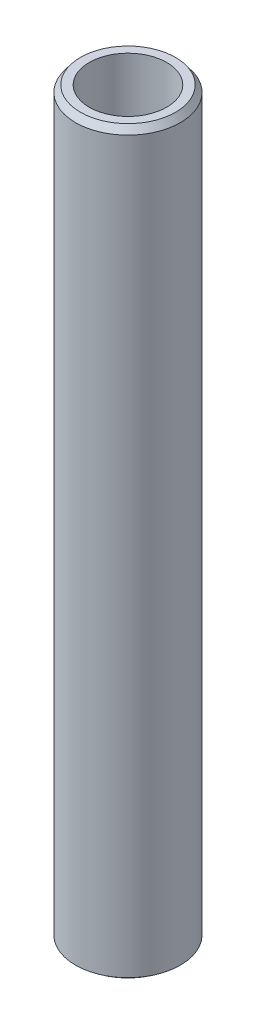
ISO-10303-21;
HEADER;
FILE_DESCRIPTION(('STEP AP214'),'2;1');
FILE_NAME('part.step','',(''),(''),'','','');
FILE_SCHEMA(('AUTOMOTIVE_DESIGN { 1 0 10303 214 1 1 1 1 }'));
ENDSEC;
DATA;
#1=APPLICATION_CONTEXT('core data for automotive mechanical design processes');
#2=APPLICATION_PROTOCOL_DEFINITION('international standard','automotive_design',2000,#1);
#3=PRODUCT_CONTEXT('',#1,'mechanical');
#4=PRODUCT('Part','Part','',(#3));
#5=PRODUCT_RELATED_PRODUCT_CATEGORY('part','',(#4));
#6=PRODUCT_DEFINITION_FORMATION('','',#4);
#7=PRODUCT_DEFINITION_CONTEXT('part definition',#1,'design');
#8=PRODUCT_DEFINITION('design','',#6,#7);
#9=PRODUCT_DEFINITION_SHAPE('','',#8);
#10=(LENGTH_UNIT() NAMED_UNIT(*) SI_UNIT(.MILLI.,.METRE.));
#11=(NAMED_UNIT(*) PLANE_ANGLE_UNIT() SI_UNIT($,.RADIAN.));
#12=(NAMED_UNIT(*) SI_UNIT($,.STERADIAN.) SOLID_ANGLE_UNIT());
#13=UNCERTAINTY_MEASURE_WITH_UNIT(LENGTH_MEASURE(1.E-05),#10,'distance_accuracy_value','');
#14=(GEOMETRIC_REPRESENTATION_CONTEXT(3) GLOBAL_UNCERTAINTY_ASSIGNED_CONTEXT((#13)) GLOBAL_UNIT_ASSIGNED_CONTEXT((#10,
#11,#12)) REPRESENTATION_CONTEXT('',''));
#15=CARTESIAN_POINT('',(0.,0.,0.));
#16=DIRECTION('',(0.,0.,1.));
#17=DIRECTION('',(1.,0.,0.));
#18=AXIS2_PLACEMENT_3D('',#15,#16,#17);
#19=CARTESIAN_POINT('',(0.,212.051565752174,0.));
#20=DIRECTION('',(0.,-1.,0.));
#21=DIRECTION('',(0.,0.,-1.));
#22=AXIS2_PLACEMENT_3D('',#19,#20,#21);
#23=CYLINDRICAL_SURFACE('',#22,15.);
#24=CARTESIAN_POINT('',(0.,210.178905890822,0.));
#25=DIRECTION('',(0.,1.,0.));
#26=DIRECTION('',(0.,0.,1.));
#27=AXIS2_PLACEMENT_3D('',#24,#25,#26);
#28=CIRCLE('',#27,15.);
#29=CARTESIAN_POINT('',(0.,210.178905890822,15.));
#30=VERTEX_POINT('',#29);
#31=EDGE_CURVE('E50',#30,#30,#28,.F.);
#32=ORIENTED_EDGE('',*,*,#31,.T.);
#33=EDGE_LOOP('',(#32));
#34=FACE_BOUND('',#33,.T.);
#35=CARTESIAN_POINT('',(0.,1.39279228129038,0.));
#36=DIRECTION('',(0.,1.,0.));
#37=DIRECTION('',(0.,0.,1.));
#38=AXIS2_PLACEMENT_3D('',#35,#36,#37);
#39=CIRCLE('',#38,15.);
#40=CARTESIAN_POINT('',(0.,1.39279228129038,15.));
#41=VERTEX_POINT('',#40);
#42=EDGE_CURVE('E51',#41,#41,#39,.T.);
#43=ORIENTED_EDGE('',*,*,#42,.T.);
#44=EDGE_LOOP('',(#43));
#45=FACE_BOUND('',#44,.T.);
#46=ADVANCED_FACE('F39',(#34,#45),#23,.T.);
#47=CARTESIAN_POINT('',(0.,212.051565752174,0.));
#48=DIRECTION('',(0.,1.,0.));
#49=DIRECTION('',(0.,0.,1.));
#50=AXIS2_PLACEMENT_3D('',#47,#48,#49);
#51=PLANE('',#50);
#52=CARTESIAN_POINT('',(0.,212.051565752174,0.));
#53=DIRECTION('',(0.,1.,0.));
#54=DIRECTION('',(0.,0.,1.));
#55=AXIS2_PLACEMENT_3D('',#52,#53,#54);
#56=CIRCLE('',#55,13.6072077187096);
#57=CARTESIAN_POINT('',(0.,212.051565752174,13.6072077187096));
#58=VERTEX_POINT('',#57);
#59=EDGE_CURVE('E54',#58,#58,#56,.T.);
#60=ORIENTED_EDGE('',*,*,#59,.T.);
#61=EDGE_LOOP('',(#60));
#62=FACE_BOUND('',#61,.T.);
#63=CARTESIAN_POINT('',(0.,212.051565752174,0.));
#64=DIRECTION('',(0.,1.,0.));
#65=DIRECTION('',(0.,0.,1.));
#66=AXIS2_PLACEMENT_3D('',#63,#64,#65);
#67=CIRCLE('',#66,11.097342256974);
#68=CARTESIAN_POINT('',(0.,212.051565752174,11.097342256974));
#69=VERTEX_POINT('',#68);
#70=EDGE_CURVE('E58',#69,#69,#67,.T.);
#71=ORIENTED_EDGE('',*,*,#70,.F.);
#72=EDGE_LOOP('',(#71));
#73=FACE_BOUND('',#72,.T.);
#74=ADVANCED_FACE('F69',(#62,#73),#51,.T.);
#75=CARTESIAN_POINT('',(0.,0.,0.));
#76=DIRECTION('',(0.,1.,0.));
#77=DIRECTION('',(0.,0.,1.));
#78=AXIS2_PLACEMENT_3D('',#75,#76,#77);
#79=PLANE('',#78);
#80=CARTESIAN_POINT('',(0.,0.,0.));
#81=DIRECTION('',(0.,1.,0.));
#82=DIRECTION('',(0.,0.,1.));
#83=AXIS2_PLACEMENT_3D('',#80,#81,#82);
#84=CIRCLE('',#83,13.1273401386477);
#85=CARTESIAN_POINT('',(0.,0.,13.1273401386477));
#86=VERTEX_POINT('',#85);
#87=EDGE_CURVE('E10',#86,#86,#84,.F.);
#88=ORIENTED_EDGE('',*,*,#87,.T.);
#89=EDGE_LOOP('',(#88));
#90=FACE_BOUND('',#89,.T.);
#91=CARTESIAN_POINT('',(0.,0.,0.));
#92=DIRECTION('',(0.,1.,0.));
#93=DIRECTION('',(0.,0.,1.));
#94=AXIS2_PLACEMENT_3D('',#91,#92,#93);
#95=CIRCLE('',#94,11.097342256974);
#96=CARTESIAN_POINT('',(0.,0.,11.097342256974));
#97=VERTEX_POINT('',#96);
#98=EDGE_CURVE('E63',#97,#97,#95,.T.);
#99=ORIENTED_EDGE('',*,*,#98,.T.);
#100=EDGE_LOOP('',(#99));
#101=FACE_BOUND('',#100,.T.);
#102=ADVANCED_FACE('F75',(#90,#101),#79,.F.);
#103=CARTESIAN_POINT('',(0.,212.051565752174,0.));
#104=DIRECTION('',(0.,-1.,0.));
#105=DIRECTION('',(0.,0.,-1.));
#106=AXIS2_PLACEMENT_3D('',#103,#104,#105);
#107=CYLINDRICAL_SURFACE('',#106,11.097342256974);
#108=ORIENTED_EDGE('',*,*,#70,.T.);
#109=EDGE_LOOP('',(#108));
#110=FACE_BOUND('',#109,.T.);
#111=ORIENTED_EDGE('',*,*,#98,.F.);
#112=EDGE_LOOP('',(#111));
#113=FACE_BOUND('',#112,.T.);
#114=ADVANCED_FACE('F70',(#110,#113),#107,.F.);
#115=CARTESIAN_POINT('',(0.,212.051565752174,0.));
#116=DIRECTION('',(0.,-1.,0.));
#117=DIRECTION('',(0.,0.,-1.));
#118=AXIS2_PLACEMENT_3D('',#115,#116,#117);
#119=CONICAL_SURFACE('',#118,13.6072077187096,0.639489613167436);
#120=ORIENTED_EDGE('',*,*,#31,.F.);
#121=EDGE_LOOP('',(#120));
#122=FACE_BOUND('',#121,.T.);
#123=ORIENTED_EDGE('',*,*,#59,.F.);
#124=EDGE_LOOP('',(#123));
#125=FACE_BOUND('',#124,.T.);
#126=ADVANCED_FACE('F81',(#122,#125),#119,.T.);
#127=CARTESIAN_POINT('',(0.,1.39279228129038,0.));
#128=DIRECTION('',(0.,1.,0.));
#129=DIRECTION('',(0.,0.,1.));
#130=AXIS2_PLACEMENT_3D('',#127,#128,#129);
#131=CONICAL_SURFACE('',#130,15.,0.931306713627452);
#132=ORIENTED_EDGE('',*,*,#87,.F.);
#133=EDGE_LOOP('',(#132));
#134=FACE_BOUND('',#133,.T.);
#135=ORIENTED_EDGE('',*,*,#42,.F.);
#136=EDGE_LOOP('',(#135));
#137=FACE_BOUND('',#136,.T.);
#138=ADVANCED_FACE('F45',(#134,#137),#131,.T.);
#139=CLOSED_SHELL('',(#46,#74,#102,#114,#126,#138));
#140=MANIFOLD_SOLID_BREP('B2',#139);
#141=ADVANCED_BREP_SHAPE_REPRESENTATION('',(#18,#140),#14);
#142=SHAPE_DEFINITION_REPRESENTATION(#9,#141);
ENDSEC;
END-ISO-10303-21;
